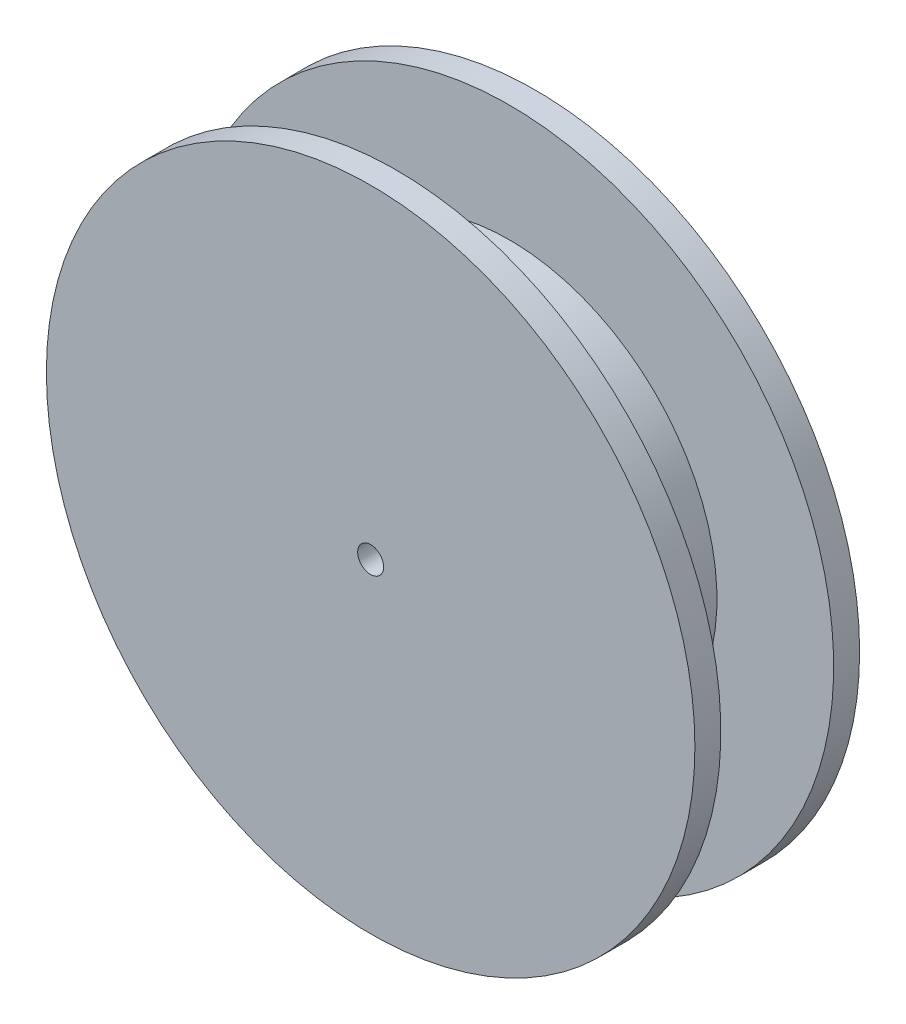
ISO-10303-21;
HEADER;
FILE_DESCRIPTION(('STEP AP214'),'2;1');
FILE_NAME('part.step','',(''),(''),'','','');
FILE_SCHEMA(('AUTOMOTIVE_DESIGN { 1 0 10303 214 1 1 1 1 }'));
ENDSEC;
DATA;
#1=APPLICATION_CONTEXT('core data for automotive mechanical design processes');
#2=APPLICATION_PROTOCOL_DEFINITION('international standard','automotive_design',2000,#1);
#3=PRODUCT_CONTEXT('',#1,'mechanical');
#4=PRODUCT('Part','Part','',(#3));
#5=PRODUCT_RELATED_PRODUCT_CATEGORY('part','',(#4));
#6=PRODUCT_DEFINITION_FORMATION('','',#4);
#7=PRODUCT_DEFINITION_CONTEXT('part definition',#1,'design');
#8=PRODUCT_DEFINITION('design','',#6,#7);
#9=PRODUCT_DEFINITION_SHAPE('','',#8);
#10=(LENGTH_UNIT() NAMED_UNIT(*) SI_UNIT(.MILLI.,.METRE.));
#11=(NAMED_UNIT(*) PLANE_ANGLE_UNIT() SI_UNIT($,.RADIAN.));
#12=(NAMED_UNIT(*) SI_UNIT($,.STERADIAN.) SOLID_ANGLE_UNIT());
#13=UNCERTAINTY_MEASURE_WITH_UNIT(LENGTH_MEASURE(1.E-05),#10,'distance_accuracy_value','');
#14=(GEOMETRIC_REPRESENTATION_CONTEXT(3) GLOBAL_UNCERTAINTY_ASSIGNED_CONTEXT((#13)) GLOBAL_UNIT_ASSIGNED_CONTEXT((#10,
#11,#12)) REPRESENTATION_CONTEXT('',''));
#15=CARTESIAN_POINT('',(0.,0.,0.));
#16=DIRECTION('',(0.,0.,1.));
#17=DIRECTION('',(1.,0.,0.));
#18=AXIS2_PLACEMENT_3D('',#15,#16,#17);
#19=CARTESIAN_POINT('',(0.,0.,6.35));
#20=DIRECTION('',(0.,0.,-1.));
#21=DIRECTION('',(-1.,0.,0.));
#22=AXIS2_PLACEMENT_3D('',#19,#20,#21);
#23=CYLINDRICAL_SURFACE('',#22,12.5);
#24=CARTESIAN_POINT('',(0.,0.,5.35));
#25=DIRECTION('',(0.,0.,-1.));
#26=DIRECTION('',(-1.,0.,0.));
#27=AXIS2_PLACEMENT_3D('',#24,#25,#26);
#28=CIRCLE('',#27,12.5);
#29=CARTESIAN_POINT('',(-12.5,0.,5.35));
#30=VERTEX_POINT('',#29);
#31=EDGE_CURVE('E47',#30,#30,#28,.T.);
#32=ORIENTED_EDGE('',*,*,#31,.F.);
#33=EDGE_LOOP('',(#32));
#34=FACE_BOUND('',#33,.T.);
#35=CARTESIAN_POINT('',(0.,0.,6.35));
#36=DIRECTION('',(0.,0.,1.));
#37=DIRECTION('',(1.,0.,0.));
#38=AXIS2_PLACEMENT_3D('',#35,#36,#37);
#39=CIRCLE('',#38,12.5);
#40=CARTESIAN_POINT('',(12.5,0.,6.35));
#41=VERTEX_POINT('',#40);
#42=EDGE_CURVE('E10',#41,#41,#39,.T.);
#43=ORIENTED_EDGE('',*,*,#42,.F.);
#44=EDGE_LOOP('',(#43));
#45=FACE_BOUND('',#44,.T.);
#46=ADVANCED_FACE('F31',(#34,#45),#23,.T.);
#47=CARTESIAN_POINT('',(0.,0.,6.35));
#48=DIRECTION('',(0.,0.,1.));
#49=DIRECTION('',(1.,0.,0.));
#50=AXIS2_PLACEMENT_3D('',#47,#48,#49);
#51=PLANE('',#50);
#52=ORIENTED_EDGE('',*,*,#42,.T.);
#53=EDGE_LOOP('',(#52));
#54=FACE_BOUND('',#53,.T.);
#55=CARTESIAN_POINT('',(0.,0.,6.35));
#56=DIRECTION('',(0.,0.,1.));
#57=DIRECTION('',(1.,0.,0.));
#58=AXIS2_PLACEMENT_3D('',#55,#56,#57);
#59=CIRCLE('',#58,0.5);
#60=CARTESIAN_POINT('',(0.5,0.,6.35));
#61=VERTEX_POINT('',#60);
#62=EDGE_CURVE('E42',#61,#61,#59,.T.);
#63=ORIENTED_EDGE('',*,*,#62,.F.);
#64=EDGE_LOOP('',(#63));
#65=FACE_BOUND('',#64,.T.);
#66=ADVANCED_FACE('F74',(#54,#65),#51,.T.);
#67=CARTESIAN_POINT('',(0.,0.,0.));
#68=DIRECTION('',(0.,0.,1.));
#69=DIRECTION('',(1.,0.,0.));
#70=AXIS2_PLACEMENT_3D('',#67,#68,#69);
#71=PLANE('',#70);
#72=CARTESIAN_POINT('',(0.,0.,0.));
#73=DIRECTION('',(0.,0.,1.));
#74=DIRECTION('',(1.,0.,0.));
#75=AXIS2_PLACEMENT_3D('',#72,#73,#74);
#76=CIRCLE('',#75,12.5);
#77=CARTESIAN_POINT('',(12.5,0.,0.));
#78=VERTEX_POINT('',#77);
#79=EDGE_CURVE('E35',#78,#78,#76,.T.);
#80=ORIENTED_EDGE('',*,*,#79,.F.);
#81=EDGE_LOOP('',(#80));
#82=FACE_BOUND('',#81,.T.);
#83=CARTESIAN_POINT('',(0.,0.,0.));
#84=DIRECTION('',(0.,0.,1.));
#85=DIRECTION('',(1.,0.,0.));
#86=AXIS2_PLACEMENT_3D('',#83,#84,#85);
#87=CIRCLE('',#86,0.5);
#88=CARTESIAN_POINT('',(0.5,0.,0.));
#89=VERTEX_POINT('',#88);
#90=EDGE_CURVE('E44',#89,#89,#87,.T.);
#91=ORIENTED_EDGE('',*,*,#90,.T.);
#92=EDGE_LOOP('',(#91));
#93=FACE_BOUND('',#92,.T.);
#94=ADVANCED_FACE('F78',(#82,#93),#71,.F.);
#95=CARTESIAN_POINT('',(0.,0.,1.));
#96=DIRECTION('',(0.,0.,-1.));
#97=DIRECTION('',(-1.,0.,0.));
#98=AXIS2_PLACEMENT_3D('',#95,#96,#97);
#99=CIRCLE('',#98,12.5);
#100=CARTESIAN_POINT('',(-12.5,0.,1.));
#101=VERTEX_POINT('',#100);
#102=EDGE_CURVE('E52',#101,#101,#99,.T.);
#103=ORIENTED_EDGE('',*,*,#102,.T.);
#104=EDGE_LOOP('',(#103));
#105=FACE_BOUND('',#104,.T.);
#106=ORIENTED_EDGE('',*,*,#79,.T.);
#107=EDGE_LOOP('',(#106));
#108=FACE_BOUND('',#107,.T.);
#109=ADVANCED_FACE('F33',(#105,#108),#23,.T.);
#110=CARTESIAN_POINT('',(0.,0.,6.35));
#111=DIRECTION('',(0.,0.,-1.));
#112=DIRECTION('',(-1.,0.,0.));
#113=AXIS2_PLACEMENT_3D('',#110,#111,#112);
#114=CYLINDRICAL_SURFACE('',#113,0.5);
#115=ORIENTED_EDGE('',*,*,#62,.T.);
#116=EDGE_LOOP('',(#115));
#117=FACE_BOUND('',#116,.T.);
#118=ORIENTED_EDGE('',*,*,#90,.F.);
#119=EDGE_LOOP('',(#118));
#120=FACE_BOUND('',#119,.T.);
#121=ADVANCED_FACE('F68',(#117,#120),#114,.F.);
#122=CARTESIAN_POINT('',(0.,8.,5.35));
#123=DIRECTION('',(0.,0.,1.));
#124=DIRECTION('',(1.,0.,0.));
#125=AXIS2_PLACEMENT_3D('',#122,#123,#124);
#126=PLANE('',#125);
#127=CARTESIAN_POINT('',(0.,0.,5.35));
#128=DIRECTION('',(0.,0.,-1.));
#129=DIRECTION('',(-1.,0.,0.));
#130=AXIS2_PLACEMENT_3D('',#127,#128,#129);
#131=CIRCLE('',#130,8.);
#132=CARTESIAN_POINT('',(-8.,0.,5.35));
#133=VERTEX_POINT('',#132);
#134=EDGE_CURVE('E58',#133,#133,#131,.T.);
#135=ORIENTED_EDGE('',*,*,#134,.F.);
#136=EDGE_LOOP('',(#135));
#137=FACE_BOUND('',#136,.T.);
#138=ORIENTED_EDGE('',*,*,#31,.T.);
#139=EDGE_LOOP('',(#138));
#140=FACE_BOUND('',#139,.T.);
#141=ADVANCED_FACE('F64',(#137,#140),#126,.F.);
#142=CARTESIAN_POINT('',(0.,12.5,1.));
#143=DIRECTION('',(0.,0.,-1.));
#144=DIRECTION('',(-1.,0.,0.));
#145=AXIS2_PLACEMENT_3D('',#142,#143,#144);
#146=PLANE('',#145);
#147=ORIENTED_EDGE('',*,*,#102,.F.);
#148=EDGE_LOOP('',(#147));
#149=FACE_BOUND('',#148,.T.);
#150=CARTESIAN_POINT('',(0.,0.,1.));
#151=DIRECTION('',(0.,0.,-1.));
#152=DIRECTION('',(-1.,0.,0.));
#153=AXIS2_PLACEMENT_3D('',#150,#151,#152);
#154=CIRCLE('',#153,8.);
#155=CARTESIAN_POINT('',(-8.,0.,1.));
#156=VERTEX_POINT('',#155);
#157=EDGE_CURVE('E55',#156,#156,#154,.T.);
#158=ORIENTED_EDGE('',*,*,#157,.T.);
#159=EDGE_LOOP('',(#158));
#160=FACE_BOUND('',#159,.T.);
#161=ADVANCED_FACE('F67',(#149,#160),#146,.F.);
#162=CARTESIAN_POINT('',(0.,0.,0.));
#163=DIRECTION('',(0.,0.,-1.));
#164=DIRECTION('',(-1.,0.,0.));
#165=AXIS2_PLACEMENT_3D('',#162,#163,#164);
#166=CYLINDRICAL_SURFACE('',#165,8.);
#167=ORIENTED_EDGE('',*,*,#157,.F.);
#168=EDGE_LOOP('',(#167));
#169=FACE_BOUND('',#168,.T.);
#170=ORIENTED_EDGE('',*,*,#134,.T.);
#171=EDGE_LOOP('',(#170));
#172=FACE_BOUND('',#171,.T.);
#173=ADVANCED_FACE('F62',(#169,#172),#166,.T.);
#174=CLOSED_SHELL('',(#46,#66,#94,#109,#121,#141,#161,#173));
#175=MANIFOLD_SOLID_BREP('B2',#174);
#176=ADVANCED_BREP_SHAPE_REPRESENTATION('',(#18,#175),#14);
#177=SHAPE_DEFINITION_REPRESENTATION(#9,#176);
ENDSEC;
END-ISO-10303-21;
